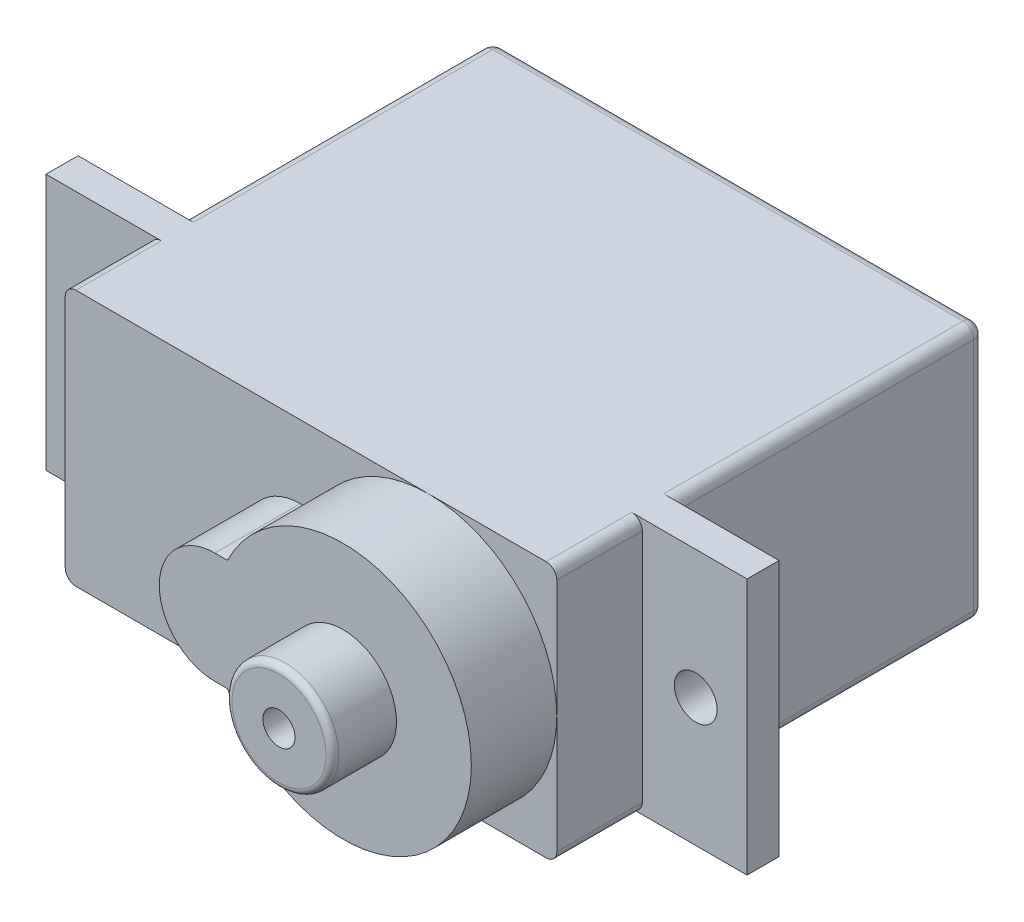
ISO-10303-21;
HEADER;
FILE_DESCRIPTION(('STEP AP214'),'2;1');
FILE_NAME('part.step','',(''),(''),'','','');
FILE_SCHEMA(('AUTOMOTIVE_DESIGN { 1 0 10303 214 1 1 1 1 }'));
ENDSEC;
DATA;
#1=APPLICATION_CONTEXT('core data for automotive mechanical design processes');
#2=APPLICATION_PROTOCOL_DEFINITION('international standard','automotive_design',2000,#1);
#3=PRODUCT_CONTEXT('',#1,'mechanical');
#4=PRODUCT('Part','Part','',(#3));
#5=PRODUCT_RELATED_PRODUCT_CATEGORY('part','',(#4));
#6=PRODUCT_DEFINITION_FORMATION('','',#4);
#7=PRODUCT_DEFINITION_CONTEXT('part definition',#1,'design');
#8=PRODUCT_DEFINITION('design','',#6,#7);
#9=PRODUCT_DEFINITION_SHAPE('','',#8);
#10=(LENGTH_UNIT() NAMED_UNIT(*) SI_UNIT(.MILLI.,.METRE.));
#11=(NAMED_UNIT(*) PLANE_ANGLE_UNIT() SI_UNIT($,.RADIAN.));
#12=(NAMED_UNIT(*) SI_UNIT($,.STERADIAN.) SOLID_ANGLE_UNIT());
#13=UNCERTAINTY_MEASURE_WITH_UNIT(LENGTH_MEASURE(1.E-05),#10,'distance_accuracy_value','');
#14=(GEOMETRIC_REPRESENTATION_CONTEXT(3) GLOBAL_UNCERTAINTY_ASSIGNED_CONTEXT((#13)) GLOBAL_UNIT_ASSIGNED_CONTEXT((#10,
#11,#12)) REPRESENTATION_CONTEXT('',''));
#15=CARTESIAN_POINT('',(0.,0.,0.));
#16=DIRECTION('',(0.,0.,1.));
#17=DIRECTION('',(1.,0.,0.));
#18=AXIS2_PLACEMENT_3D('',#15,#16,#17);
#19=CARTESIAN_POINT('',(0.,0.,5.5));
#20=DIRECTION('',(0.,0.,1.));
#21=DIRECTION('',(1.,0.,0.));
#22=AXIS2_PLACEMENT_3D('',#19,#20,#21);
#23=PLANE('',#22);
#24=DIRECTION('',(0.,-1.,0.));
#25=VECTOR('',#24,1.);
#26=CARTESIAN_POINT('',(-11.5,6.,5.5));
#27=LINE('',#26,#25);
#28=CARTESIAN_POINT('',(-11.5,5.5,5.5));
#29=VERTEX_POINT('',#28);
#30=CARTESIAN_POINT('',(-11.5,-5.5,5.5));
#31=VERTEX_POINT('',#30);
#32=EDGE_CURVE('E290',#29,#31,#27,.T.);
#33=ORIENTED_EDGE('',*,*,#32,.T.);
#34=CARTESIAN_POINT('',(-11.,-5.5,5.5));
#35=DIRECTION('',(0.,0.,1.));
#36=DIRECTION('',(1.,0.,0.));
#37=AXIS2_PLACEMENT_3D('',#34,#35,#36);
#38=CIRCLE('',#37,0.5);
#39=CARTESIAN_POINT('',(-11.,-6.,5.5));
#40=VERTEX_POINT('',#39);
#41=EDGE_CURVE('E546',#31,#40,#38,.T.);
#42=ORIENTED_EDGE('',*,*,#41,.T.);
#43=DIRECTION('',(1.,0.,0.));
#44=VECTOR('',#43,1.);
#45=CARTESIAN_POINT('',(-11.5,-6.,5.5));
#46=LINE('',#45,#44);
#47=CARTESIAN_POINT('',(5.5,-6.,5.5));
#48=VERTEX_POINT('',#47);
#49=EDGE_CURVE('E461',#40,#48,#46,.T.);
#50=ORIENTED_EDGE('',*,*,#49,.T.);
#51=CARTESIAN_POINT('',(5.5,0.,5.5));
#52=DIRECTION('',(0.,0.,1.));
#53=DIRECTION('',(1.,0.,0.));
#54=AXIS2_PLACEMENT_3D('',#51,#52,#53);
#55=CIRCLE('',#54,6.);
#56=CARTESIAN_POINT('',(0.0925976661616881,-2.6,5.5));
#57=VERTEX_POINT('',#56);
#58=EDGE_CURVE('E440',#57,#48,#55,.T.);
#59=ORIENTED_EDGE('',*,*,#58,.F.);
#60=DIRECTION('',(1.,0.,0.));
#61=VECTOR('',#60,1.);
#62=CARTESIAN_POINT('',(-0.5,-2.6,5.5));
#63=LINE('',#62,#61);
#64=CARTESIAN_POINT('',(-0.5,-2.6,5.5));
#65=VERTEX_POINT('',#64);
#66=EDGE_CURVE('E242',#65,#57,#63,.T.);
#67=ORIENTED_EDGE('',*,*,#66,.F.);
#68=CARTESIAN_POINT('',(-0.5,0.,5.5));
#69=DIRECTION('',(0.,0.,1.));
#70=DIRECTION('',(1.,0.,0.));
#71=AXIS2_PLACEMENT_3D('',#68,#69,#70);
#72=CIRCLE('',#71,2.6);
#73=CARTESIAN_POINT('',(-0.5,2.6,5.5));
#74=VERTEX_POINT('',#73);
#75=EDGE_CURVE('E449',#74,#65,#72,.T.);
#76=ORIENTED_EDGE('',*,*,#75,.F.);
#77=DIRECTION('',(-1.,0.,0.));
#78=VECTOR('',#77,1.);
#79=CARTESIAN_POINT('',(-0.5,2.6,5.5));
#80=LINE('',#79,#78);
#81=CARTESIAN_POINT('',(0.0925976661616881,2.6,5.5));
#82=VERTEX_POINT('',#81);
#83=EDGE_CURVE('E446',#82,#74,#80,.T.);
#84=ORIENTED_EDGE('',*,*,#83,.F.);
#85=CARTESIAN_POINT('',(5.5,6.,5.5));
#86=VERTEX_POINT('',#85);
#87=EDGE_CURVE('E249',#86,#82,#55,.T.);
#88=ORIENTED_EDGE('',*,*,#87,.F.);
#89=DIRECTION('',(-1.,0.,0.));
#90=VECTOR('',#89,1.);
#91=CARTESIAN_POINT('',(-11.5,6.,5.5));
#92=LINE('',#91,#90);
#93=CARTESIAN_POINT('',(-11.,6.,5.5));
#94=VERTEX_POINT('',#93);
#95=EDGE_CURVE('E570',#86,#94,#92,.T.);
#96=ORIENTED_EDGE('',*,*,#95,.T.);
#97=CARTESIAN_POINT('',(-11.,5.5,5.5));
#98=DIRECTION('',(0.,0.,1.));
#99=DIRECTION('',(1.,0.,0.));
#100=AXIS2_PLACEMENT_3D('',#97,#98,#99);
#101=CIRCLE('',#100,0.5);
#102=EDGE_CURVE('E60',#94,#29,#101,.T.);
#103=ORIENTED_EDGE('',*,*,#102,.T.);
#104=EDGE_LOOP('',(#33,#42,#50,#59,#67,#76,#84,#88,#96,#103));
#105=FACE_BOUND('',#104,.T.);
#106=ADVANCED_FACE('F36',(#105),#23,.T.);
#107=CARTESIAN_POINT('',(11.,-6.,5.5));
#108=VERTEX_POINT('',#107);
#109=EDGE_CURVE('E571',#48,#108,#46,.T.);
#110=ORIENTED_EDGE('',*,*,#109,.T.);
#111=CARTESIAN_POINT('',(11.,-5.5,5.5));
#112=DIRECTION('',(0.,0.,1.));
#113=DIRECTION('',(1.,0.,0.));
#114=AXIS2_PLACEMENT_3D('',#111,#112,#113);
#115=CIRCLE('',#114,0.5);
#116=CARTESIAN_POINT('',(11.5,-5.5,5.5));
#117=VERTEX_POINT('',#116);
#118=EDGE_CURVE('E556',#108,#117,#115,.T.);
#119=ORIENTED_EDGE('',*,*,#118,.T.);
#120=DIRECTION('',(0.,1.,0.));
#121=VECTOR('',#120,1.);
#122=CARTESIAN_POINT('',(11.5,6.,5.5));
#123=LINE('',#122,#121);
#124=CARTESIAN_POINT('',(11.5,0.,5.5));
#125=VERTEX_POINT('',#124);
#126=EDGE_CURVE('E568',#117,#125,#123,.T.);
#127=ORIENTED_EDGE('',*,*,#126,.T.);
#128=EDGE_CURVE('E447',#48,#125,#55,.T.);
#129=ORIENTED_EDGE('',*,*,#128,.F.);
#130=EDGE_LOOP('',(#110,#119,#127,#129));
#131=FACE_BOUND('',#130,.T.);
#132=ADVANCED_FACE('F588',(#131),#23,.T.);
#133=CARTESIAN_POINT('',(0.,0.,0.));
#134=DIRECTION('',(0.,0.,1.));
#135=DIRECTION('',(1.,0.,0.));
#136=AXIS2_PLACEMENT_3D('',#133,#134,#135);
#137=PLANE('',#136);
#138=CARTESIAN_POINT('',(14.,0.,0.));
#139=DIRECTION('',(0.,0.,1.));
#140=DIRECTION('',(1.,0.,0.));
#141=AXIS2_PLACEMENT_3D('',#138,#139,#140);
#142=CIRCLE('',#141,1.);
#143=CARTESIAN_POINT('',(15.,0.,0.));
#144=VERTEX_POINT('',#143);
#145=EDGE_CURVE('E253',#144,#144,#142,.T.);
#146=ORIENTED_EDGE('',*,*,#145,.T.);
#147=EDGE_LOOP('',(#146));
#148=FACE_BOUND('',#147,.T.);
#149=DIRECTION('',(0.,-1.,0.));
#150=VECTOR('',#149,1.);
#151=CARTESIAN_POINT('',(11.5,6.,0.));
#152=LINE('',#151,#150);
#153=CARTESIAN_POINT('',(11.5,5.5,0.));
#154=VERTEX_POINT('',#153);
#155=CARTESIAN_POINT('',(11.5,-5.5,0.));
#156=VERTEX_POINT('',#155);
#157=EDGE_CURVE('E267',#154,#156,#152,.T.);
#158=ORIENTED_EDGE('',*,*,#157,.F.);
#159=CARTESIAN_POINT('',(11.,5.5,0.));
#160=DIRECTION('',(0.,0.,1.));
#161=DIRECTION('',(1.,0.,0.));
#162=AXIS2_PLACEMENT_3D('',#159,#160,#161);
#163=CIRCLE('',#162,0.5);
#164=CARTESIAN_POINT('',(11.,6.,0.));
#165=VERTEX_POINT('',#164);
#166=EDGE_CURVE('E369',#154,#165,#163,.T.);
#167=ORIENTED_EDGE('',*,*,#166,.T.);
#168=DIRECTION('',(-1.,0.,0.));
#169=VECTOR('',#168,1.);
#170=CARTESIAN_POINT('',(-16.4,6.,0.));
#171=LINE('',#170,#169);
#172=CARTESIAN_POINT('',(16.4,6.,0.));
#173=VERTEX_POINT('',#172);
#174=EDGE_CURVE('E302',#173,#165,#171,.T.);
#175=ORIENTED_EDGE('',*,*,#174,.F.);
#176=DIRECTION('',(0.,1.,0.));
#177=VECTOR('',#176,1.);
#178=CARTESIAN_POINT('',(16.4,6.,0.));
#179=LINE('',#178,#177);
#180=CARTESIAN_POINT('',(16.4,-6.,0.));
#181=VERTEX_POINT('',#180);
#182=EDGE_CURVE('E328',#181,#173,#179,.T.);
#183=ORIENTED_EDGE('',*,*,#182,.F.);
#184=DIRECTION('',(1.,0.,0.));
#185=VECTOR('',#184,1.);
#186=CARTESIAN_POINT('',(-16.4,-6.,0.));
#187=LINE('',#186,#185);
#188=CARTESIAN_POINT('',(11.,-6.,0.));
#189=VERTEX_POINT('',#188);
#190=EDGE_CURVE('E342',#189,#181,#187,.T.);
#191=ORIENTED_EDGE('',*,*,#190,.F.);
#192=CARTESIAN_POINT('',(11.,-5.5,0.));
#193=DIRECTION('',(0.,0.,1.));
#194=DIRECTION('',(1.,0.,0.));
#195=AXIS2_PLACEMENT_3D('',#192,#193,#194);
#196=CIRCLE('',#195,0.5);
#197=EDGE_CURVE('E539',#189,#156,#196,.T.);
#198=ORIENTED_EDGE('',*,*,#197,.T.);
#199=EDGE_LOOP('',(#158,#167,#175,#183,#191,#198));
#200=FACE_BOUND('',#199,.T.);
#201=ADVANCED_FACE('F366',(#148,#200),#137,.F.);
#202=CARTESIAN_POINT('',(-14.,0.,0.));
#203=DIRECTION('',(0.,0.,1.));
#204=DIRECTION('',(1.,0.,0.));
#205=AXIS2_PLACEMENT_3D('',#202,#203,#204);
#206=CIRCLE('',#205,1.);
#207=CARTESIAN_POINT('',(-13.,0.,0.));
#208=VERTEX_POINT('',#207);
#209=EDGE_CURVE('E264',#208,#208,#206,.T.);
#210=ORIENTED_EDGE('',*,*,#209,.T.);
#211=EDGE_LOOP('',(#210));
#212=FACE_BOUND('',#211,.T.);
#213=DIRECTION('',(0.,1.,0.));
#214=VECTOR('',#213,1.);
#215=CARTESIAN_POINT('',(-11.5,6.,0.));
#216=LINE('',#215,#214);
#217=CARTESIAN_POINT('',(-11.5,-5.5,0.));
#218=VERTEX_POINT('',#217);
#219=CARTESIAN_POINT('',(-11.5,5.5,0.));
#220=VERTEX_POINT('',#219);
#221=EDGE_CURVE('E276',#218,#220,#216,.T.);
#222=ORIENTED_EDGE('',*,*,#221,.F.);
#223=CARTESIAN_POINT('',(-11.,-5.5,0.));
#224=DIRECTION('',(0.,0.,1.));
#225=DIRECTION('',(1.,0.,0.));
#226=AXIS2_PLACEMENT_3D('',#223,#224,#225);
#227=CIRCLE('',#226,0.5);
#228=CARTESIAN_POINT('',(-11.,-6.,0.));
#229=VERTEX_POINT('',#228);
#230=EDGE_CURVE('E391',#218,#229,#227,.T.);
#231=ORIENTED_EDGE('',*,*,#230,.T.);
#232=CARTESIAN_POINT('',(-16.4,-6.,0.));
#233=VERTEX_POINT('',#232);
#234=EDGE_CURVE('E348',#233,#229,#187,.T.);
#235=ORIENTED_EDGE('',*,*,#234,.F.);
#236=DIRECTION('',(0.,-1.,0.));
#237=VECTOR('',#236,1.);
#238=CARTESIAN_POINT('',(-16.4,6.,0.));
#239=LINE('',#238,#237);
#240=CARTESIAN_POINT('',(-16.4,6.,0.));
#241=VERTEX_POINT('',#240);
#242=EDGE_CURVE('E339',#241,#233,#239,.T.);
#243=ORIENTED_EDGE('',*,*,#242,.F.);
#244=CARTESIAN_POINT('',(-11.,6.,0.));
#245=VERTEX_POINT('',#244);
#246=EDGE_CURVE('E332',#245,#241,#171,.T.);
#247=ORIENTED_EDGE('',*,*,#246,.F.);
#248=CARTESIAN_POINT('',(-11.,5.5,0.));
#249=DIRECTION('',(0.,0.,1.));
#250=DIRECTION('',(1.,0.,0.));
#251=AXIS2_PLACEMENT_3D('',#248,#249,#250);
#252=CIRCLE('',#251,0.5);
#253=EDGE_CURVE('E388',#245,#220,#252,.T.);
#254=ORIENTED_EDGE('',*,*,#253,.T.);
#255=EDGE_LOOP('',(#222,#231,#235,#243,#247,#254));
#256=FACE_BOUND('',#255,.T.);
#257=ADVANCED_FACE('F627',(#212,#256),#137,.F.);
#258=CARTESIAN_POINT('',(0.,0.,1.5));
#259=DIRECTION('',(0.,0.,1.));
#260=DIRECTION('',(1.,0.,0.));
#261=AXIS2_PLACEMENT_3D('',#258,#259,#260);
#262=PLANE('',#261);
#263=CARTESIAN_POINT('',(-14.,0.,1.5));
#264=DIRECTION('',(0.,0.,1.));
#265=DIRECTION('',(1.,0.,0.));
#266=AXIS2_PLACEMENT_3D('',#263,#264,#265);
#267=CIRCLE('',#266,1.);
#268=CARTESIAN_POINT('',(-13.,0.,1.5));
#269=VERTEX_POINT('',#268);
#270=EDGE_CURVE('E261',#269,#269,#267,.T.);
#271=ORIENTED_EDGE('',*,*,#270,.F.);
#272=EDGE_LOOP('',(#271));
#273=FACE_BOUND('',#272,.T.);
#274=DIRECTION('',(0.,-1.,0.));
#275=VECTOR('',#274,1.);
#276=CARTESIAN_POINT('',(-11.5,6.,1.5));
#277=LINE('',#276,#275);
#278=CARTESIAN_POINT('',(-11.5,5.5,1.5));
#279=VERTEX_POINT('',#278);
#280=CARTESIAN_POINT('',(-11.5,-5.5,1.5));
#281=VERTEX_POINT('',#280);
#282=EDGE_CURVE('E291',#279,#281,#277,.T.);
#283=ORIENTED_EDGE('',*,*,#282,.F.);
#284=CARTESIAN_POINT('',(-11.,5.5,1.5));
#285=DIRECTION('',(0.,0.,1.));
#286=DIRECTION('',(1.,0.,0.));
#287=AXIS2_PLACEMENT_3D('',#284,#285,#286);
#288=CIRCLE('',#287,0.5);
#289=CARTESIAN_POINT('',(-11.,6.,1.5));
#290=VERTEX_POINT('',#289);
#291=EDGE_CURVE('E11',#279,#290,#288,.F.);
#292=ORIENTED_EDGE('',*,*,#291,.T.);
#293=DIRECTION('',(-1.,0.,0.));
#294=VECTOR('',#293,1.);
#295=CARTESIAN_POINT('',(-16.4,6.,1.5));
#296=LINE('',#295,#294);
#297=CARTESIAN_POINT('',(-16.4,6.,1.5));
#298=VERTEX_POINT('',#297);
#299=EDGE_CURVE('E336',#290,#298,#296,.T.);
#300=ORIENTED_EDGE('',*,*,#299,.T.);
#301=DIRECTION('',(0.,-1.,0.));
#302=VECTOR('',#301,1.);
#303=CARTESIAN_POINT('',(-16.4,6.,1.5));
#304=LINE('',#303,#302);
#305=CARTESIAN_POINT('',(-16.4,-6.,1.5));
#306=VERTEX_POINT('',#305);
#307=EDGE_CURVE('E298',#298,#306,#304,.T.);
#308=ORIENTED_EDGE('',*,*,#307,.T.);
#309=DIRECTION('',(1.,0.,0.));
#310=VECTOR('',#309,1.);
#311=CARTESIAN_POINT('',(-16.4,-6.,1.5));
#312=LINE('',#311,#310);
#313=CARTESIAN_POINT('',(-11.,-6.,1.5));
#314=VERTEX_POINT('',#313);
#315=EDGE_CURVE('E311',#306,#314,#312,.T.);
#316=ORIENTED_EDGE('',*,*,#315,.T.);
#317=CARTESIAN_POINT('',(-11.,-5.5,1.5));
#318=DIRECTION('',(0.,0.,1.));
#319=DIRECTION('',(1.,0.,0.));
#320=AXIS2_PLACEMENT_3D('',#317,#318,#319);
#321=CIRCLE('',#320,0.5);
#322=EDGE_CURVE('E45',#314,#281,#321,.F.);
#323=ORIENTED_EDGE('',*,*,#322,.T.);
#324=EDGE_LOOP('',(#283,#292,#300,#308,#316,#323));
#325=FACE_BOUND('',#324,.T.);
#326=ADVANCED_FACE('F580',(#273,#325),#262,.T.);
#327=CARTESIAN_POINT('',(-16.4,6.,1.5));
#328=DIRECTION('',(1.,0.,0.));
#329=DIRECTION('',(0.,0.,-1.));
#330=AXIS2_PLACEMENT_3D('',#327,#328,#329);
#331=PLANE('',#330);
#332=ORIENTED_EDGE('',*,*,#242,.T.);
#333=DIRECTION('',(0.,0.,-1.));
#334=VECTOR('',#333,1.);
#335=CARTESIAN_POINT('',(-16.4,-6.,1.5));
#336=LINE('',#335,#334);
#337=EDGE_CURVE('E313',#306,#233,#336,.T.);
#338=ORIENTED_EDGE('',*,*,#337,.F.);
#339=ORIENTED_EDGE('',*,*,#307,.F.);
#340=DIRECTION('',(0.,0.,-1.));
#341=VECTOR('',#340,1.);
#342=CARTESIAN_POINT('',(-16.4,6.,1.5));
#343=LINE('',#342,#341);
#344=EDGE_CURVE('E322',#298,#241,#343,.T.);
#345=ORIENTED_EDGE('',*,*,#344,.T.);
#346=EDGE_LOOP('',(#332,#338,#339,#345));
#347=FACE_BOUND('',#346,.T.);
#348=ADVANCED_FACE('F635',(#347),#331,.F.);
#349=CARTESIAN_POINT('',(-16.4,-6.,1.5));
#350=DIRECTION('',(0.,1.,0.));
#351=DIRECTION('',(-1.,0.,0.));
#352=AXIS2_PLACEMENT_3D('',#349,#350,#351);
#353=PLANE('',#352);
#354=CARTESIAN_POINT('',(11.,-6.,1.5));
#355=VERTEX_POINT('',#354);
#356=CARTESIAN_POINT('',(16.4,-6.,1.5));
#357=VERTEX_POINT('',#356);
#358=EDGE_CURVE('E301',#355,#357,#312,.T.);
#359=ORIENTED_EDGE('',*,*,#358,.F.);
#360=DIRECTION('',(0.,0.,-1.));
#361=VECTOR('',#360,1.);
#362=CARTESIAN_POINT('',(11.,-6.,1.5));
#363=LINE('',#362,#361);
#364=EDGE_CURVE('E494',#355,#108,#363,.F.);
#365=ORIENTED_EDGE('',*,*,#364,.T.);
#366=ORIENTED_EDGE('',*,*,#109,.F.);
#367=ORIENTED_EDGE('',*,*,#49,.F.);
#368=DIRECTION('',(0.,0.,-1.));
#369=VECTOR('',#368,1.);
#370=CARTESIAN_POINT('',(-11.,-6.,1.5));
#371=LINE('',#370,#369);
#372=EDGE_CURVE('E486',#40,#314,#371,.T.);
#373=ORIENTED_EDGE('',*,*,#372,.T.);
#374=ORIENTED_EDGE('',*,*,#315,.F.);
#375=ORIENTED_EDGE('',*,*,#337,.T.);
#376=ORIENTED_EDGE('',*,*,#234,.T.);
#377=DIRECTION('',(0.,0.,1.));
#378=VECTOR('',#377,1.);
#379=CARTESIAN_POINT('',(-11.,-6.,1.5));
#380=LINE('',#379,#378);
#381=CARTESIAN_POINT('',(-11.,-6.,-14.));
#382=VERTEX_POINT('',#381);
#383=EDGE_CURVE('E489',#229,#382,#380,.F.);
#384=ORIENTED_EDGE('',*,*,#383,.T.);
#385=DIRECTION('',(-1.,0.,0.));
#386=VECTOR('',#385,1.);
#387=CARTESIAN_POINT('',(11.5,-6.,-14.));
#388=LINE('',#387,#386);
#389=CARTESIAN_POINT('',(11.,-6.,-14.));
#390=VERTEX_POINT('',#389);
#391=EDGE_CURVE('E491',#382,#390,#388,.F.);
#392=ORIENTED_EDGE('',*,*,#391,.T.);
#393=DIRECTION('',(0.,0.,1.));
#394=VECTOR('',#393,1.);
#395=CARTESIAN_POINT('',(11.,-6.,1.5));
#396=LINE('',#395,#394);
#397=EDGE_CURVE('E357',#390,#189,#396,.T.);
#398=ORIENTED_EDGE('',*,*,#397,.T.);
#399=ORIENTED_EDGE('',*,*,#190,.T.);
#400=DIRECTION('',(0.,0.,-1.));
#401=VECTOR('',#400,1.);
#402=CARTESIAN_POINT('',(16.4,-6.,1.5));
#403=LINE('',#402,#401);
#404=EDGE_CURVE('E316',#357,#181,#403,.T.);
#405=ORIENTED_EDGE('',*,*,#404,.F.);
#406=EDGE_LOOP('',(#359,#365,#366,#367,#373,#374,#375,#376,#384,#392,#398,#399,#405));
#407=FACE_BOUND('',#406,.T.);
#408=ADVANCED_FACE('F353',(#407),#353,.F.);
#409=CARTESIAN_POINT('',(16.4,6.,1.5));
#410=DIRECTION('',(-1.,0.,0.));
#411=DIRECTION('',(0.,0.,1.));
#412=AXIS2_PLACEMENT_3D('',#409,#410,#411);
#413=PLANE('',#412);
#414=ORIENTED_EDGE('',*,*,#182,.T.);
#415=DIRECTION('',(0.,0.,-1.));
#416=VECTOR('',#415,1.);
#417=CARTESIAN_POINT('',(16.4,6.,1.5));
#418=LINE('',#417,#416);
#419=CARTESIAN_POINT('',(16.4,6.,1.5));
#420=VERTEX_POINT('',#419);
#421=EDGE_CURVE('E319',#420,#173,#418,.T.);
#422=ORIENTED_EDGE('',*,*,#421,.F.);
#423=DIRECTION('',(0.,1.,0.));
#424=VECTOR('',#423,1.);
#425=CARTESIAN_POINT('',(16.4,6.,1.5));
#426=LINE('',#425,#424);
#427=EDGE_CURVE('E305',#357,#420,#426,.T.);
#428=ORIENTED_EDGE('',*,*,#427,.F.);
#429=ORIENTED_EDGE('',*,*,#404,.T.);
#430=EDGE_LOOP('',(#414,#422,#428,#429));
#431=FACE_BOUND('',#430,.T.);
#432=ADVANCED_FACE('F362',(#431),#413,.F.);
#433=CARTESIAN_POINT('',(-16.4,6.,1.5));
#434=DIRECTION('',(0.,-1.,0.));
#435=DIRECTION('',(1.,0.,0.));
#436=AXIS2_PLACEMENT_3D('',#433,#434,#435);
#437=PLANE('',#436);
#438=ORIENTED_EDGE('',*,*,#174,.T.);
#439=DIRECTION('',(0.,0.,1.));
#440=VECTOR('',#439,1.);
#441=CARTESIAN_POINT('',(11.,6.,1.5));
#442=LINE('',#441,#440);
#443=CARTESIAN_POINT('',(11.,6.,-14.));
#444=VERTEX_POINT('',#443);
#445=EDGE_CURVE('E277',#165,#444,#442,.F.);
#446=ORIENTED_EDGE('',*,*,#445,.T.);
#447=DIRECTION('',(1.,0.,0.));
#448=VECTOR('',#447,1.);
#449=CARTESIAN_POINT('',(-11.5,6.,-14.));
#450=LINE('',#449,#448);
#451=CARTESIAN_POINT('',(-11.,6.,-14.));
#452=VERTEX_POINT('',#451);
#453=EDGE_CURVE('E509',#444,#452,#450,.F.);
#454=ORIENTED_EDGE('',*,*,#453,.T.);
#455=DIRECTION('',(0.,0.,1.));
#456=VECTOR('',#455,1.);
#457=CARTESIAN_POINT('',(-11.,6.,1.5));
#458=LINE('',#457,#456);
#459=EDGE_CURVE('E507',#452,#245,#458,.T.);
#460=ORIENTED_EDGE('',*,*,#459,.T.);
#461=ORIENTED_EDGE('',*,*,#246,.T.);
#462=ORIENTED_EDGE('',*,*,#344,.F.);
#463=ORIENTED_EDGE('',*,*,#299,.F.);
#464=DIRECTION('',(0.,0.,-1.));
#465=VECTOR('',#464,1.);
#466=CARTESIAN_POINT('',(-11.,6.,1.5));
#467=LINE('',#466,#465);
#468=EDGE_CURVE('E504',#290,#94,#467,.F.);
#469=ORIENTED_EDGE('',*,*,#468,.T.);
#470=ORIENTED_EDGE('',*,*,#95,.F.);
#471=CARTESIAN_POINT('',(11.,6.,5.5));
#472=VERTEX_POINT('',#471);
#473=EDGE_CURVE('E343',#472,#86,#92,.T.);
#474=ORIENTED_EDGE('',*,*,#473,.F.);
#475=DIRECTION('',(0.,0.,-1.));
#476=VECTOR('',#475,1.);
#477=CARTESIAN_POINT('',(11.,6.,1.5));
#478=LINE('',#477,#476);
#479=CARTESIAN_POINT('',(11.,6.,1.5));
#480=VERTEX_POINT('',#479);
#481=EDGE_CURVE('E378',#472,#480,#478,.T.);
#482=ORIENTED_EDGE('',*,*,#481,.T.);
#483=EDGE_CURVE('E325',#420,#480,#296,.T.);
#484=ORIENTED_EDGE('',*,*,#483,.F.);
#485=ORIENTED_EDGE('',*,*,#421,.T.);
#486=EDGE_LOOP('',(#438,#446,#454,#460,#461,#462,#463,#469,#470,#474,#482,#484,#485));
#487=FACE_BOUND('',#486,.T.);
#488=ADVANCED_FACE('F372',(#487),#437,.F.);
#489=CARTESIAN_POINT('',(14.,0.,1.5));
#490=DIRECTION('',(0.,0.,1.));
#491=DIRECTION('',(1.,0.,0.));
#492=AXIS2_PLACEMENT_3D('',#489,#490,#491);
#493=CIRCLE('',#492,1.);
#494=CARTESIAN_POINT('',(15.,0.,1.5));
#495=VERTEX_POINT('',#494);
#496=EDGE_CURVE('E250',#495,#495,#493,.T.);
#497=ORIENTED_EDGE('',*,*,#496,.F.);
#498=EDGE_LOOP('',(#497));
#499=FACE_BOUND('',#498,.T.);
#500=DIRECTION('',(0.,1.,0.));
#501=VECTOR('',#500,1.);
#502=CARTESIAN_POINT('',(11.5,6.,1.5));
#503=LINE('',#502,#501);
#504=CARTESIAN_POINT('',(11.5,-5.5,1.5));
#505=VERTEX_POINT('',#504);
#506=CARTESIAN_POINT('',(11.5,5.5,1.5));
#507=VERTEX_POINT('',#506);
#508=EDGE_CURVE('E286',#505,#507,#503,.T.);
#509=ORIENTED_EDGE('',*,*,#508,.F.);
#510=CARTESIAN_POINT('',(11.,-5.5,1.5));
#511=DIRECTION('',(0.,0.,1.));
#512=DIRECTION('',(1.,0.,0.));
#513=AXIS2_PLACEMENT_3D('',#510,#511,#512);
#514=CIRCLE('',#513,0.5);
#515=EDGE_CURVE('E543',#505,#355,#514,.F.);
#516=ORIENTED_EDGE('',*,*,#515,.T.);
#517=ORIENTED_EDGE('',*,*,#358,.T.);
#518=ORIENTED_EDGE('',*,*,#427,.T.);
#519=ORIENTED_EDGE('',*,*,#483,.T.);
#520=CARTESIAN_POINT('',(11.,5.5,1.5));
#521=DIRECTION('',(0.,0.,1.));
#522=DIRECTION('',(1.,0.,0.));
#523=AXIS2_PLACEMENT_3D('',#520,#521,#522);
#524=CIRCLE('',#523,0.5);
#525=EDGE_CURVE('E383',#480,#507,#524,.F.);
#526=ORIENTED_EDGE('',*,*,#525,.T.);
#527=EDGE_LOOP('',(#509,#516,#517,#518,#519,#526));
#528=FACE_BOUND('',#527,.T.);
#529=ADVANCED_FACE('F382',(#499,#528),#262,.T.);
#530=CARTESIAN_POINT('',(-11.5,6.,5.5));
#531=DIRECTION('',(1.,0.,0.));
#532=DIRECTION('',(0.,1.,0.));
#533=AXIS2_PLACEMENT_3D('',#530,#531,#532);
#534=PLANE('',#533);
#535=ORIENTED_EDGE('',*,*,#282,.T.);
#536=DIRECTION('',(0.,0.,-1.));
#537=VECTOR('',#536,1.);
#538=CARTESIAN_POINT('',(-11.5,-5.5,5.5));
#539=LINE('',#538,#537);
#540=EDGE_CURVE('E53',#281,#31,#539,.F.);
#541=ORIENTED_EDGE('',*,*,#540,.T.);
#542=ORIENTED_EDGE('',*,*,#32,.F.);
#543=DIRECTION('',(0.,0.,-1.));
#544=VECTOR('',#543,1.);
#545=CARTESIAN_POINT('',(-11.5,5.5,5.5));
#546=LINE('',#545,#544);
#547=EDGE_CURVE('E550',#29,#279,#546,.T.);
#548=ORIENTED_EDGE('',*,*,#547,.T.);
#549=EDGE_LOOP('',(#535,#541,#542,#548));
#550=FACE_BOUND('',#549,.T.);
#551=ADVANCED_FACE('F578',(#550),#534,.F.);
#552=CARTESIAN_POINT('',(11.5,6.,5.5));
#553=DIRECTION('',(-1.,0.,0.));
#554=DIRECTION('',(0.,0.,1.));
#555=AXIS2_PLACEMENT_3D('',#552,#553,#554);
#556=PLANE('',#555);
#557=ORIENTED_EDGE('',*,*,#126,.F.);
#558=DIRECTION('',(0.,0.,-1.));
#559=VECTOR('',#558,1.);
#560=CARTESIAN_POINT('',(11.5,-5.5,5.5));
#561=LINE('',#560,#559);
#562=EDGE_CURVE('E557',#117,#505,#561,.T.);
#563=ORIENTED_EDGE('',*,*,#562,.T.);
#564=ORIENTED_EDGE('',*,*,#508,.T.);
#565=DIRECTION('',(0.,0.,-1.));
#566=VECTOR('',#565,1.);
#567=CARTESIAN_POINT('',(11.5,5.5,5.5));
#568=LINE('',#567,#566);
#569=CARTESIAN_POINT('',(11.5,5.5,5.5));
#570=VERTEX_POINT('',#569);
#571=EDGE_CURVE('E285',#507,#570,#568,.F.);
#572=ORIENTED_EDGE('',*,*,#571,.T.);
#573=EDGE_CURVE('E565',#125,#570,#123,.T.);
#574=ORIENTED_EDGE('',*,*,#573,.F.);
#575=EDGE_LOOP('',(#557,#563,#564,#572,#574));
#576=FACE_BOUND('',#575,.T.);
#577=ADVANCED_FACE('F564',(#576),#556,.F.);
#578=ORIENTED_EDGE('',*,*,#573,.T.);
#579=CARTESIAN_POINT('',(11.,5.5,5.5));
#580=DIRECTION('',(0.,0.,1.));
#581=DIRECTION('',(1.,0.,0.));
#582=AXIS2_PLACEMENT_3D('',#579,#580,#581);
#583=CIRCLE('',#582,0.5);
#584=EDGE_CURVE('E553',#570,#472,#583,.T.);
#585=ORIENTED_EDGE('',*,*,#584,.T.);
#586=ORIENTED_EDGE('',*,*,#473,.T.);
#587=EDGE_CURVE('E465',#125,#86,#55,.T.);
#588=ORIENTED_EDGE('',*,*,#587,.F.);
#589=EDGE_LOOP('',(#578,#585,#586,#588));
#590=FACE_BOUND('',#589,.T.);
#591=ADVANCED_FACE('F567',(#590),#23,.T.);
#592=CARTESIAN_POINT('',(11.5,6.,-14.5));
#593=DIRECTION('',(-1.,0.,0.));
#594=DIRECTION('',(0.,-1.,0.));
#595=AXIS2_PLACEMENT_3D('',#592,#593,#594);
#596=PLANE('',#595);
#597=ORIENTED_EDGE('',*,*,#157,.T.);
#598=DIRECTION('',(0.,0.,1.));
#599=VECTOR('',#598,1.);
#600=CARTESIAN_POINT('',(11.5,-5.5,-14.5));
#601=LINE('',#600,#599);
#602=CARTESIAN_POINT('',(11.5,-5.5,-14.));
#603=VERTEX_POINT('',#602);
#604=EDGE_CURVE('E283',#156,#603,#601,.F.);
#605=ORIENTED_EDGE('',*,*,#604,.T.);
#606=DIRECTION('',(0.,-1.,0.));
#607=VECTOR('',#606,1.);
#608=CARTESIAN_POINT('',(11.5,6.,-14.));
#609=LINE('',#608,#607);
#610=CARTESIAN_POINT('',(11.5,5.5,-14.));
#611=VERTEX_POINT('',#610);
#612=EDGE_CURVE('E281',#603,#611,#609,.F.);
#613=ORIENTED_EDGE('',*,*,#612,.T.);
#614=DIRECTION('',(0.,0.,1.));
#615=VECTOR('',#614,1.);
#616=CARTESIAN_POINT('',(11.5,5.5,-14.5));
#617=LINE('',#616,#615);
#618=EDGE_CURVE('E279',#611,#154,#617,.T.);
#619=ORIENTED_EDGE('',*,*,#618,.T.);
#620=EDGE_LOOP('',(#597,#605,#613,#619));
#621=FACE_BOUND('',#620,.T.);
#622=ADVANCED_FACE('F611',(#621),#596,.F.);
#623=CARTESIAN_POINT('',(-11.5,6.,-14.5));
#624=DIRECTION('',(1.,0.,0.));
#625=DIRECTION('',(0.,1.,0.));
#626=AXIS2_PLACEMENT_3D('',#623,#624,#625);
#627=PLANE('',#626);
#628=DIRECTION('',(0.,1.,0.));
#629=VECTOR('',#628,1.);
#630=CARTESIAN_POINT('',(-11.5,-6.,-14.));
#631=LINE('',#630,#629);
#632=CARTESIAN_POINT('',(-11.5,5.5,-14.));
#633=VERTEX_POINT('',#632);
#634=CARTESIAN_POINT('',(-11.5,-5.5,-14.));
#635=VERTEX_POINT('',#634);
#636=EDGE_CURVE('E500',#633,#635,#631,.F.);
#637=ORIENTED_EDGE('',*,*,#636,.T.);
#638=DIRECTION('',(0.,0.,1.));
#639=VECTOR('',#638,1.);
#640=CARTESIAN_POINT('',(-11.5,-5.5,-14.5));
#641=LINE('',#640,#639);
#642=EDGE_CURVE('E502',#635,#218,#641,.T.);
#643=ORIENTED_EDGE('',*,*,#642,.T.);
#644=ORIENTED_EDGE('',*,*,#221,.T.);
#645=DIRECTION('',(0.,0.,1.));
#646=VECTOR('',#645,1.);
#647=CARTESIAN_POINT('',(-11.5,5.5,-14.5));
#648=LINE('',#647,#646);
#649=EDGE_CURVE('E496',#220,#633,#648,.F.);
#650=ORIENTED_EDGE('',*,*,#649,.T.);
#651=EDGE_LOOP('',(#637,#643,#644,#650));
#652=FACE_BOUND('',#651,.T.);
#653=ADVANCED_FACE('F530',(#652),#627,.F.);
#654=CARTESIAN_POINT('',(0.,0.,-14.5));
#655=DIRECTION('',(0.,0.,-1.));
#656=DIRECTION('',(-1.,0.,0.));
#657=AXIS2_PLACEMENT_3D('',#654,#655,#656);
#658=PLANE('',#657);
#659=DIRECTION('',(0.,-1.,0.));
#660=VECTOR('',#659,1.);
#661=CARTESIAN_POINT('',(11.,-6.,-14.5));
#662=LINE('',#661,#660);
#663=CARTESIAN_POINT('',(11.,5.5,-14.5));
#664=VERTEX_POINT('',#663);
#665=CARTESIAN_POINT('',(11.,-5.5,-14.5));
#666=VERTEX_POINT('',#665);
#667=EDGE_CURVE('E475',#664,#666,#662,.T.);
#668=ORIENTED_EDGE('',*,*,#667,.T.);
#669=DIRECTION('',(-1.,0.,0.));
#670=VECTOR('',#669,1.);
#671=CARTESIAN_POINT('',(-11.5,-5.5,-14.5));
#672=LINE('',#671,#670);
#673=CARTESIAN_POINT('',(-11.,-5.5,-14.5));
#674=VERTEX_POINT('',#673);
#675=EDGE_CURVE('E483',#666,#674,#672,.T.);
#676=ORIENTED_EDGE('',*,*,#675,.T.);
#677=DIRECTION('',(0.,1.,0.));
#678=VECTOR('',#677,1.);
#679=CARTESIAN_POINT('',(-11.,6.,-14.5));
#680=LINE('',#679,#678);
#681=CARTESIAN_POINT('',(-11.,5.5,-14.5));
#682=VERTEX_POINT('',#681);
#683=EDGE_CURVE('E481',#674,#682,#680,.T.);
#684=ORIENTED_EDGE('',*,*,#683,.T.);
#685=DIRECTION('',(1.,0.,0.));
#686=VECTOR('',#685,1.);
#687=CARTESIAN_POINT('',(11.5,5.5,-14.5));
#688=LINE('',#687,#686);
#689=EDGE_CURVE('E479',#682,#664,#688,.T.);
#690=ORIENTED_EDGE('',*,*,#689,.T.);
#691=EDGE_LOOP('',(#668,#676,#684,#690));
#692=FACE_BOUND('',#691,.T.);
#693=ADVANCED_FACE('F689',(#692),#658,.T.);
#694=CARTESIAN_POINT('',(-14.,0.,-0.5));
#695=DIRECTION('',(0.,0.,1.));
#696=DIRECTION('',(1.,0.,0.));
#697=AXIS2_PLACEMENT_3D('',#694,#695,#696);
#698=CYLINDRICAL_SURFACE('',#697,1.);
#699=ORIENTED_EDGE('',*,*,#270,.T.);
#700=EDGE_LOOP('',(#699));
#701=FACE_BOUND('',#700,.T.);
#702=ORIENTED_EDGE('',*,*,#209,.F.);
#703=EDGE_LOOP('',(#702));
#704=FACE_BOUND('',#703,.T.);
#705=ADVANCED_FACE('F693',(#701,#704),#698,.F.);
#706=CARTESIAN_POINT('',(14.,0.,-0.5));
#707=DIRECTION('',(0.,0.,1.));
#708=DIRECTION('',(1.,0.,0.));
#709=AXIS2_PLACEMENT_3D('',#706,#707,#708);
#710=CYLINDRICAL_SURFACE('',#709,1.);
#711=ORIENTED_EDGE('',*,*,#496,.T.);
#712=EDGE_LOOP('',(#711));
#713=FACE_BOUND('',#712,.T.);
#714=ORIENTED_EDGE('',*,*,#145,.F.);
#715=EDGE_LOOP('',(#714));
#716=FACE_BOUND('',#715,.T.);
#717=ADVANCED_FACE('F699',(#713,#716),#710,.F.);
#718=CARTESIAN_POINT('',(5.5,0.,9.5));
#719=DIRECTION('',(0.,0.,-1.));
#720=DIRECTION('',(-1.,0.,0.));
#721=AXIS2_PLACEMENT_3D('',#718,#719,#720);
#722=CYLINDRICAL_SURFACE('',#721,6.);
#723=ORIENTED_EDGE('',*,*,#58,.T.);
#724=ORIENTED_EDGE('',*,*,#128,.T.);
#725=ORIENTED_EDGE('',*,*,#587,.T.);
#726=ORIENTED_EDGE('',*,*,#87,.T.);
#727=DIRECTION('',(0.,0.,-1.));
#728=VECTOR('',#727,1.);
#729=CARTESIAN_POINT('',(0.0925976661616881,2.6,9.5));
#730=LINE('',#729,#728);
#731=CARTESIAN_POINT('',(0.0925976661616881,2.6,9.5));
#732=VERTEX_POINT('',#731);
#733=EDGE_CURVE('E227',#732,#82,#730,.T.);
#734=ORIENTED_EDGE('',*,*,#733,.F.);
#735=CARTESIAN_POINT('',(5.5,0.,9.5));
#736=DIRECTION('',(0.,0.,1.));
#737=DIRECTION('',(1.,0.,0.));
#738=AXIS2_PLACEMENT_3D('',#735,#736,#737);
#739=CIRCLE('',#738,6.);
#740=CARTESIAN_POINT('',(0.0925976661616881,-2.6,9.5));
#741=VERTEX_POINT('',#740);
#742=EDGE_CURVE('E233',#741,#732,#739,.T.);
#743=ORIENTED_EDGE('',*,*,#742,.F.);
#744=DIRECTION('',(0.,0.,-1.));
#745=VECTOR('',#744,1.);
#746=CARTESIAN_POINT('',(0.0925976661616881,-2.6,9.5));
#747=LINE('',#746,#745);
#748=EDGE_CURVE('E444',#741,#57,#747,.T.);
#749=ORIENTED_EDGE('',*,*,#748,.T.);
#750=EDGE_LOOP('',(#723,#724,#725,#726,#734,#743,#749));
#751=FACE_BOUND('',#750,.T.);
#752=ADVANCED_FACE('F246',(#751),#722,.T.);
#753=CARTESIAN_POINT('',(-0.5,2.6,9.5));
#754=DIRECTION('',(0.,-1.,0.));
#755=DIRECTION('',(0.,0.,-1.));
#756=AXIS2_PLACEMENT_3D('',#753,#754,#755);
#757=PLANE('',#756);
#758=ORIENTED_EDGE('',*,*,#83,.T.);
#759=DIRECTION('',(0.,0.,-1.));
#760=VECTOR('',#759,1.);
#761=CARTESIAN_POINT('',(-0.5,2.6,9.5));
#762=LINE('',#761,#760);
#763=CARTESIAN_POINT('',(-0.5,2.6,9.5));
#764=VERTEX_POINT('',#763);
#765=EDGE_CURVE('E229',#764,#74,#762,.T.);
#766=ORIENTED_EDGE('',*,*,#765,.F.);
#767=DIRECTION('',(-1.,0.,0.));
#768=VECTOR('',#767,1.);
#769=CARTESIAN_POINT('',(-0.5,2.6,9.5));
#770=LINE('',#769,#768);
#771=EDGE_CURVE('E222',#732,#764,#770,.T.);
#772=ORIENTED_EDGE('',*,*,#771,.F.);
#773=ORIENTED_EDGE('',*,*,#733,.T.);
#774=EDGE_LOOP('',(#758,#766,#772,#773));
#775=FACE_BOUND('',#774,.T.);
#776=ADVANCED_FACE('F225',(#775),#757,.F.);
#777=CARTESIAN_POINT('',(-0.5,0.,9.5));
#778=DIRECTION('',(0.,0.,-1.));
#779=DIRECTION('',(-1.,0.,0.));
#780=AXIS2_PLACEMENT_3D('',#777,#778,#779);
#781=CYLINDRICAL_SURFACE('',#780,2.6);
#782=ORIENTED_EDGE('',*,*,#75,.T.);
#783=DIRECTION('',(0.,0.,-1.));
#784=VECTOR('',#783,1.);
#785=CARTESIAN_POINT('',(-0.5,-2.6,9.5));
#786=LINE('',#785,#784);
#787=CARTESIAN_POINT('',(-0.5,-2.6,9.5));
#788=VERTEX_POINT('',#787);
#789=EDGE_CURVE('E255',#788,#65,#786,.T.);
#790=ORIENTED_EDGE('',*,*,#789,.F.);
#791=CARTESIAN_POINT('',(-0.5,0.,9.5));
#792=DIRECTION('',(0.,0.,1.));
#793=DIRECTION('',(1.,0.,0.));
#794=AXIS2_PLACEMENT_3D('',#791,#792,#793);
#795=CIRCLE('',#794,2.6);
#796=EDGE_CURVE('E232',#764,#788,#795,.T.);
#797=ORIENTED_EDGE('',*,*,#796,.F.);
#798=ORIENTED_EDGE('',*,*,#765,.T.);
#799=EDGE_LOOP('',(#782,#790,#797,#798));
#800=FACE_BOUND('',#799,.T.);
#801=ADVANCED_FACE('F459',(#800),#781,.T.);
#802=CARTESIAN_POINT('',(-0.5,-2.6,9.5));
#803=DIRECTION('',(0.,1.,0.));
#804=DIRECTION('',(0.,0.,1.));
#805=AXIS2_PLACEMENT_3D('',#802,#803,#804);
#806=PLANE('',#805);
#807=ORIENTED_EDGE('',*,*,#66,.T.);
#808=ORIENTED_EDGE('',*,*,#748,.F.);
#809=DIRECTION('',(1.,0.,0.));
#810=VECTOR('',#809,1.);
#811=CARTESIAN_POINT('',(-0.5,-2.6,9.5));
#812=LINE('',#811,#810);
#813=EDGE_CURVE('E238',#788,#741,#812,.T.);
#814=ORIENTED_EDGE('',*,*,#813,.F.);
#815=ORIENTED_EDGE('',*,*,#789,.T.);
#816=EDGE_LOOP('',(#807,#808,#814,#815));
#817=FACE_BOUND('',#816,.T.);
#818=ADVANCED_FACE('F457',(#817),#806,.F.);
#819=CARTESIAN_POINT('',(5.5,0.,9.5));
#820=DIRECTION('',(0.,0.,1.));
#821=DIRECTION('',(1.,0.,0.));
#822=AXIS2_PLACEMENT_3D('',#819,#820,#821);
#823=PLANE('',#822);
#824=CARTESIAN_POINT('',(5.5,0.,9.5));
#825=DIRECTION('',(0.,0.,1.));
#826=DIRECTION('',(1.,0.,0.));
#827=AXIS2_PLACEMENT_3D('',#824,#825,#826);
#828=CIRCLE('',#827,2.5);
#829=CARTESIAN_POINT('',(8.,0.,9.5));
#830=VERTEX_POINT('',#829);
#831=EDGE_CURVE('E436',#830,#830,#828,.T.);
#832=ORIENTED_EDGE('',*,*,#831,.F.);
#833=EDGE_LOOP('',(#832));
#834=FACE_BOUND('',#833,.T.);
#835=ORIENTED_EDGE('',*,*,#742,.T.);
#836=ORIENTED_EDGE('',*,*,#771,.T.);
#837=ORIENTED_EDGE('',*,*,#796,.T.);
#838=ORIENTED_EDGE('',*,*,#813,.T.);
#839=EDGE_LOOP('',(#835,#836,#837,#838));
#840=FACE_BOUND('',#839,.T.);
#841=ADVANCED_FACE('F236',(#834,#840),#823,.T.);
#842=CARTESIAN_POINT('',(5.5,0.,12.5));
#843=DIRECTION('',(0.,0.,-1.));
#844=DIRECTION('',(-1.,0.,0.));
#845=AXIS2_PLACEMENT_3D('',#842,#843,#844);
#846=CYLINDRICAL_SURFACE('',#845,2.5);
#847=CARTESIAN_POINT('',(5.5,0.,12.2));
#848=DIRECTION('',(0.,0.,1.));
#849=DIRECTION('',(1.,0.,0.));
#850=AXIS2_PLACEMENT_3D('',#847,#848,#849);
#851=CIRCLE('',#850,2.5);
#852=CARTESIAN_POINT('',(8.,0.,12.2));
#853=VERTEX_POINT('',#852);
#854=EDGE_CURVE('E471',#853,#853,#851,.F.);
#855=ORIENTED_EDGE('',*,*,#854,.T.);
#856=EDGE_LOOP('',(#855));
#857=FACE_BOUND('',#856,.T.);
#858=ORIENTED_EDGE('',*,*,#831,.T.);
#859=EDGE_LOOP('',(#858));
#860=FACE_BOUND('',#859,.T.);
#861=ADVANCED_FACE('F717',(#857,#860),#846,.T.);
#862=CARTESIAN_POINT('',(5.5,0.,12.5));
#863=DIRECTION('',(0.,0.,1.));
#864=DIRECTION('',(1.,0.,0.));
#865=AXIS2_PLACEMENT_3D('',#862,#863,#864);
#866=PLANE('',#865);
#867=CARTESIAN_POINT('',(5.5,0.,12.5));
#868=DIRECTION('',(0.,0.,1.));
#869=DIRECTION('',(1.,0.,0.));
#870=AXIS2_PLACEMENT_3D('',#867,#868,#869);
#871=CIRCLE('',#870,0.75);
#872=CARTESIAN_POINT('',(6.25,0.,12.5));
#873=VERTEX_POINT('',#872);
#874=EDGE_CURVE('E428',#873,#873,#871,.T.);
#875=ORIENTED_EDGE('',*,*,#874,.F.);
#876=EDGE_LOOP('',(#875));
#877=FACE_BOUND('',#876,.T.);
#878=CARTESIAN_POINT('',(5.5,0.,12.5));
#879=DIRECTION('',(0.,0.,1.));
#880=DIRECTION('',(1.,0.,0.));
#881=AXIS2_PLACEMENT_3D('',#878,#879,#880);
#882=CIRCLE('',#881,2.2);
#883=CARTESIAN_POINT('',(7.7,0.,12.5));
#884=VERTEX_POINT('',#883);
#885=EDGE_CURVE('E469',#884,#884,#882,.T.);
#886=ORIENTED_EDGE('',*,*,#885,.T.);
#887=EDGE_LOOP('',(#886));
#888=FACE_BOUND('',#887,.T.);
#889=ADVANCED_FACE('F642',(#877,#888),#866,.T.);
#890=CARTESIAN_POINT('',(5.5,0.,12.2));
#891=DIRECTION('',(0.,0.,1.));
#892=DIRECTION('',(1.,0.,0.));
#893=AXIS2_PLACEMENT_3D('',#890,#891,#892);
#894=TOROIDAL_SURFACE('',#893,2.2,0.3);
#895=ORIENTED_EDGE('',*,*,#854,.F.);
#896=EDGE_LOOP('',(#895));
#897=FACE_BOUND('',#896,.T.);
#898=ORIENTED_EDGE('',*,*,#885,.F.);
#899=EDGE_LOOP('',(#898));
#900=FACE_BOUND('',#899,.T.);
#901=ADVANCED_FACE('F639',(#897,#900),#894,.T.);
#902=CARTESIAN_POINT('',(5.5,0.,7.5));
#903=DIRECTION('',(0.,0.,1.));
#904=DIRECTION('',(1.,0.,0.));
#905=AXIS2_PLACEMENT_3D('',#902,#903,#904);
#906=CYLINDRICAL_SURFACE('',#905,0.75);
#907=CARTESIAN_POINT('',(5.5,0.,7.5));
#908=DIRECTION('',(0.,0.,1.));
#909=DIRECTION('',(1.,0.,0.));
#910=AXIS2_PLACEMENT_3D('',#907,#908,#909);
#911=CIRCLE('',#910,0.75);
#912=CARTESIAN_POINT('',(6.25,0.,7.5));
#913=VERTEX_POINT('',#912);
#914=EDGE_CURVE('E431',#913,#913,#911,.T.);
#915=ORIENTED_EDGE('',*,*,#914,.F.);
#916=EDGE_LOOP('',(#915));
#917=FACE_BOUND('',#916,.T.);
#918=ORIENTED_EDGE('',*,*,#874,.T.);
#919=EDGE_LOOP('',(#918));
#920=FACE_BOUND('',#919,.T.);
#921=ADVANCED_FACE('F641',(#917,#920),#906,.F.);
#922=CARTESIAN_POINT('',(5.5,0.,7.5));
#923=DIRECTION('',(0.,0.,1.));
#924=DIRECTION('',(1.,0.,0.));
#925=AXIS2_PLACEMENT_3D('',#922,#923,#924);
#926=PLANE('',#925);
#927=ORIENTED_EDGE('',*,*,#914,.T.);
#928=EDGE_LOOP('',(#927));
#929=FACE_BOUND('',#928,.T.);
#930=ADVANCED_FACE('F674',(#929),#926,.T.);
#931=CARTESIAN_POINT('',(11.,5.5,-14.5));
#932=DIRECTION('',(0.,0.,1.));
#933=DIRECTION('',(1.,0.,0.));
#934=AXIS2_PLACEMENT_3D('',#931,#932,#933);
#935=CYLINDRICAL_SURFACE('',#934,0.5);
#936=ORIENTED_EDGE('',*,*,#166,.F.);
#937=ORIENTED_EDGE('',*,*,#618,.F.);
#938=CARTESIAN_POINT('',(11.,5.5,-14.));
#939=DIRECTION('',(0.,0.,-1.));
#940=DIRECTION('',(-1.,0.,0.));
#941=AXIS2_PLACEMENT_3D('',#938,#939,#940);
#942=CIRCLE('',#941,0.5);
#943=EDGE_CURVE('E40',#444,#611,#942,.T.);
#944=ORIENTED_EDGE('',*,*,#943,.F.);
#945=ORIENTED_EDGE('',*,*,#445,.F.);
#946=EDGE_LOOP('',(#936,#937,#944,#945));
#947=FACE_BOUND('',#946,.T.);
#948=ADVANCED_FACE('F672',(#947),#935,.T.);
#949=CARTESIAN_POINT('',(0.,5.5,-14.));
#950=DIRECTION('',(-1.,0.,0.));
#951=DIRECTION('',(0.,-1.,0.));
#952=AXIS2_PLACEMENT_3D('',#949,#950,#951);
#953=CYLINDRICAL_SURFACE('',#952,0.5);
#954=CARTESIAN_POINT('',(-11.,5.5,-14.));
#955=DIRECTION('',(-1.,0.,0.));
#956=DIRECTION('',(0.,0.,1.));
#957=AXIS2_PLACEMENT_3D('',#954,#955,#956);
#958=CIRCLE('',#957,0.5);
#959=EDGE_CURVE('E420',#452,#682,#958,.T.);
#960=ORIENTED_EDGE('',*,*,#959,.F.);
#961=ORIENTED_EDGE('',*,*,#453,.F.);
#962=CARTESIAN_POINT('',(11.,5.5,-14.));
#963=DIRECTION('',(1.,0.,0.));
#964=DIRECTION('',(0.,1.,0.));
#965=AXIS2_PLACEMENT_3D('',#962,#963,#964);
#966=CIRCLE('',#965,0.5);
#967=EDGE_CURVE('E422',#664,#444,#966,.T.);
#968=ORIENTED_EDGE('',*,*,#967,.F.);
#969=ORIENTED_EDGE('',*,*,#689,.F.);
#970=EDGE_LOOP('',(#960,#961,#968,#969));
#971=FACE_BOUND('',#970,.T.);
#972=ADVANCED_FACE('F520',(#971),#953,.T.);
#973=CARTESIAN_POINT('',(-11.,5.5,1.5));
#974=DIRECTION('',(0.,0.,1.));
#975=DIRECTION('',(1.,0.,0.));
#976=AXIS2_PLACEMENT_3D('',#973,#974,#975);
#977=CYLINDRICAL_SURFACE('',#976,0.5);
#978=ORIENTED_EDGE('',*,*,#253,.F.);
#979=ORIENTED_EDGE('',*,*,#459,.F.);
#980=CARTESIAN_POINT('',(-11.,5.5,-14.));
#981=DIRECTION('',(0.,0.,-1.));
#982=DIRECTION('',(-1.,0.,0.));
#983=AXIS2_PLACEMENT_3D('',#980,#981,#982);
#984=CIRCLE('',#983,0.5);
#985=EDGE_CURVE('E417',#633,#452,#984,.T.);
#986=ORIENTED_EDGE('',*,*,#985,.F.);
#987=ORIENTED_EDGE('',*,*,#649,.F.);
#988=EDGE_LOOP('',(#978,#979,#986,#987));
#989=FACE_BOUND('',#988,.T.);
#990=ADVANCED_FACE('F516',(#989),#977,.T.);
#991=CARTESIAN_POINT('',(11.,5.5,-14.));
#992=DIRECTION('',(0.,0.,1.));
#993=DIRECTION('',(1.,0.,0.));
#994=AXIS2_PLACEMENT_3D('',#991,#992,#993);
#995=SPHERICAL_SURFACE('',#994,0.5);
#996=ORIENTED_EDGE('',*,*,#967,.T.);
#997=ORIENTED_EDGE('',*,*,#943,.T.);
#998=CARTESIAN_POINT('',(11.,5.5,-14.));
#999=DIRECTION('',(0.,1.,0.));
#1000=DIRECTION('',(0.,0.,1.));
#1001=AXIS2_PLACEMENT_3D('',#998,#999,#1000);
#1002=CIRCLE('',#1001,0.5);
#1003=EDGE_CURVE('E414',#664,#611,#1002,.F.);
#1004=ORIENTED_EDGE('',*,*,#1003,.F.);
#1005=EDGE_LOOP('',(#996,#997,#1004));
#1006=FACE_BOUND('',#1005,.T.);
#1007=ADVANCED_FACE('F666',(#1006),#995,.T.);
#1008=CARTESIAN_POINT('',(-11.,5.5,-14.));
#1009=DIRECTION('',(0.,0.,1.));
#1010=DIRECTION('',(1.,0.,0.));
#1011=AXIS2_PLACEMENT_3D('',#1008,#1009,#1010);
#1012=SPHERICAL_SURFACE('',#1011,0.5);
#1013=ORIENTED_EDGE('',*,*,#985,.T.);
#1014=ORIENTED_EDGE('',*,*,#959,.T.);
#1015=CARTESIAN_POINT('',(-11.,5.5,-14.));
#1016=DIRECTION('',(0.,1.,0.));
#1017=DIRECTION('',(-1.,0.,0.));
#1018=AXIS2_PLACEMENT_3D('',#1015,#1016,#1017);
#1019=CIRCLE('',#1018,0.5);
#1020=EDGE_CURVE('E411',#633,#682,#1019,.F.);
#1021=ORIENTED_EDGE('',*,*,#1020,.F.);
#1022=EDGE_LOOP('',(#1013,#1014,#1021));
#1023=FACE_BOUND('',#1022,.T.);
#1024=ADVANCED_FACE('F522',(#1023),#1012,.T.);
#1025=CARTESIAN_POINT('',(11.,-5.5,1.5));
#1026=DIRECTION('',(0.,0.,1.));
#1027=DIRECTION('',(1.,0.,0.));
#1028=AXIS2_PLACEMENT_3D('',#1025,#1026,#1027);
#1029=CYLINDRICAL_SURFACE('',#1028,0.5);
#1030=ORIENTED_EDGE('',*,*,#197,.F.);
#1031=ORIENTED_EDGE('',*,*,#397,.F.);
#1032=CARTESIAN_POINT('',(11.,-5.5,-14.));
#1033=DIRECTION('',(0.,0.,-1.));
#1034=DIRECTION('',(-1.,0.,0.));
#1035=AXIS2_PLACEMENT_3D('',#1032,#1033,#1034);
#1036=CIRCLE('',#1035,0.5);
#1037=EDGE_CURVE('E408',#603,#390,#1036,.T.);
#1038=ORIENTED_EDGE('',*,*,#1037,.F.);
#1039=ORIENTED_EDGE('',*,*,#604,.F.);
#1040=EDGE_LOOP('',(#1030,#1031,#1038,#1039));
#1041=FACE_BOUND('',#1040,.T.);
#1042=ADVANCED_FACE('F659',(#1041),#1029,.T.);
#1043=CARTESIAN_POINT('',(11.,0.,-14.));
#1044=DIRECTION('',(0.,1.,0.));
#1045=DIRECTION('',(-1.,0.,0.));
#1046=AXIS2_PLACEMENT_3D('',#1043,#1044,#1045);
#1047=CYLINDRICAL_SURFACE('',#1046,0.5);
#1048=ORIENTED_EDGE('',*,*,#1003,.T.);
#1049=ORIENTED_EDGE('',*,*,#612,.F.);
#1050=CARTESIAN_POINT('',(11.,-5.5,-14.));
#1051=DIRECTION('',(0.,-1.,0.));
#1052=DIRECTION('',(0.,0.,-1.));
#1053=AXIS2_PLACEMENT_3D('',#1050,#1051,#1052);
#1054=CIRCLE('',#1053,0.5);
#1055=EDGE_CURVE('E405',#666,#603,#1054,.T.);
#1056=ORIENTED_EDGE('',*,*,#1055,.F.);
#1057=ORIENTED_EDGE('',*,*,#667,.F.);
#1058=EDGE_LOOP('',(#1048,#1049,#1056,#1057));
#1059=FACE_BOUND('',#1058,.T.);
#1060=ADVANCED_FACE('F656',(#1059),#1047,.T.);
#1061=CARTESIAN_POINT('',(-11.,0.,-14.));
#1062=DIRECTION('',(0.,-1.,0.));
#1063=DIRECTION('',(1.,0.,0.));
#1064=AXIS2_PLACEMENT_3D('',#1061,#1062,#1063);
#1065=CYLINDRICAL_SURFACE('',#1064,0.5);
#1066=ORIENTED_EDGE('',*,*,#1020,.T.);
#1067=ORIENTED_EDGE('',*,*,#683,.F.);
#1068=CARTESIAN_POINT('',(-11.,-5.5,-14.));
#1069=DIRECTION('',(0.,-1.,0.));
#1070=DIRECTION('',(0.,0.,-1.));
#1071=AXIS2_PLACEMENT_3D('',#1068,#1069,#1070);
#1072=CIRCLE('',#1071,0.5);
#1073=EDGE_CURVE('E402',#635,#674,#1072,.T.);
#1074=ORIENTED_EDGE('',*,*,#1073,.F.);
#1075=ORIENTED_EDGE('',*,*,#636,.F.);
#1076=EDGE_LOOP('',(#1066,#1067,#1074,#1075));
#1077=FACE_BOUND('',#1076,.T.);
#1078=ADVANCED_FACE('F527',(#1077),#1065,.T.);
#1079=CARTESIAN_POINT('',(-11.,-5.5,-14.5));
#1080=DIRECTION('',(0.,0.,1.));
#1081=DIRECTION('',(1.,0.,0.));
#1082=AXIS2_PLACEMENT_3D('',#1079,#1080,#1081);
#1083=CYLINDRICAL_SURFACE('',#1082,0.5);
#1084=ORIENTED_EDGE('',*,*,#230,.F.);
#1085=ORIENTED_EDGE('',*,*,#642,.F.);
#1086=CARTESIAN_POINT('',(-11.,-5.5,-14.));
#1087=DIRECTION('',(0.,0.,-1.));
#1088=DIRECTION('',(-1.,0.,0.));
#1089=AXIS2_PLACEMENT_3D('',#1086,#1087,#1088);
#1090=CIRCLE('',#1089,0.5);
#1091=EDGE_CURVE('E399',#382,#635,#1090,.T.);
#1092=ORIENTED_EDGE('',*,*,#1091,.F.);
#1093=ORIENTED_EDGE('',*,*,#383,.F.);
#1094=EDGE_LOOP('',(#1084,#1085,#1092,#1093));
#1095=FACE_BOUND('',#1094,.T.);
#1096=ADVANCED_FACE('F535',(#1095),#1083,.T.);
#1097=CARTESIAN_POINT('',(11.,-5.5,-14.));
#1098=DIRECTION('',(0.,0.,1.));
#1099=DIRECTION('',(1.,0.,0.));
#1100=AXIS2_PLACEMENT_3D('',#1097,#1098,#1099);
#1101=SPHERICAL_SURFACE('',#1100,0.5);
#1102=ORIENTED_EDGE('',*,*,#1055,.T.);
#1103=ORIENTED_EDGE('',*,*,#1037,.T.);
#1104=CARTESIAN_POINT('',(11.,-5.5,-14.));
#1105=DIRECTION('',(1.,0.,0.));
#1106=DIRECTION('',(0.,0.,-1.));
#1107=AXIS2_PLACEMENT_3D('',#1104,#1105,#1106);
#1108=CIRCLE('',#1107,0.5);
#1109=EDGE_CURVE('E397',#666,#390,#1108,.F.);
#1110=ORIENTED_EDGE('',*,*,#1109,.F.);
#1111=EDGE_LOOP('',(#1102,#1103,#1110));
#1112=FACE_BOUND('',#1111,.T.);
#1113=ADVANCED_FACE('F647',(#1112),#1101,.T.);
#1114=CARTESIAN_POINT('',(-11.,-5.5,-14.));
#1115=DIRECTION('',(0.,0.,1.));
#1116=DIRECTION('',(1.,0.,0.));
#1117=AXIS2_PLACEMENT_3D('',#1114,#1115,#1116);
#1118=SPHERICAL_SURFACE('',#1117,0.5);
#1119=ORIENTED_EDGE('',*,*,#1091,.T.);
#1120=ORIENTED_EDGE('',*,*,#1073,.T.);
#1121=CARTESIAN_POINT('',(-11.,-5.5,-14.));
#1122=DIRECTION('',(-1.,0.,0.));
#1123=DIRECTION('',(0.,0.,1.));
#1124=AXIS2_PLACEMENT_3D('',#1121,#1122,#1123);
#1125=CIRCLE('',#1124,0.5);
#1126=EDGE_CURVE('E395',#382,#674,#1125,.F.);
#1127=ORIENTED_EDGE('',*,*,#1126,.F.);
#1128=EDGE_LOOP('',(#1119,#1120,#1127));
#1129=FACE_BOUND('',#1128,.T.);
#1130=ADVANCED_FACE('F599',(#1129),#1118,.T.);
#1131=CARTESIAN_POINT('',(0.,-5.5,-14.));
#1132=DIRECTION('',(1.,0.,0.));
#1133=DIRECTION('',(0.,1.,0.));
#1134=AXIS2_PLACEMENT_3D('',#1131,#1132,#1133);
#1135=CYLINDRICAL_SURFACE('',#1134,0.5);
#1136=ORIENTED_EDGE('',*,*,#1109,.T.);
#1137=ORIENTED_EDGE('',*,*,#391,.F.);
#1138=ORIENTED_EDGE('',*,*,#1126,.T.);
#1139=ORIENTED_EDGE('',*,*,#675,.F.);
#1140=EDGE_LOOP('',(#1136,#1137,#1138,#1139));
#1141=FACE_BOUND('',#1140,.T.);
#1142=ADVANCED_FACE('F592',(#1141),#1135,.T.);
#1143=CARTESIAN_POINT('',(11.,-5.5,5.5));
#1144=DIRECTION('',(0.,0.,-1.));
#1145=DIRECTION('',(-1.,0.,0.));
#1146=AXIS2_PLACEMENT_3D('',#1143,#1144,#1145);
#1147=CYLINDRICAL_SURFACE('',#1146,0.5);
#1148=ORIENTED_EDGE('',*,*,#118,.F.);
#1149=ORIENTED_EDGE('',*,*,#364,.F.);
#1150=ORIENTED_EDGE('',*,*,#515,.F.);
#1151=ORIENTED_EDGE('',*,*,#562,.F.);
#1152=EDGE_LOOP('',(#1148,#1149,#1150,#1151));
#1153=FACE_BOUND('',#1152,.T.);
#1154=ADVANCED_FACE('F590',(#1153),#1147,.T.);
#1155=CARTESIAN_POINT('',(11.,5.5,1.5));
#1156=DIRECTION('',(0.,0.,-1.));
#1157=DIRECTION('',(-1.,0.,0.));
#1158=AXIS2_PLACEMENT_3D('',#1155,#1156,#1157);
#1159=CYLINDRICAL_SURFACE('',#1158,0.5);
#1160=ORIENTED_EDGE('',*,*,#584,.F.);
#1161=ORIENTED_EDGE('',*,*,#571,.F.);
#1162=ORIENTED_EDGE('',*,*,#525,.F.);
#1163=ORIENTED_EDGE('',*,*,#481,.F.);
#1164=EDGE_LOOP('',(#1160,#1161,#1162,#1163));
#1165=FACE_BOUND('',#1164,.T.);
#1166=ADVANCED_FACE('F387',(#1165),#1159,.T.);
#1167=CARTESIAN_POINT('',(-11.,-5.5,1.5));
#1168=DIRECTION('',(0.,0.,-1.));
#1169=DIRECTION('',(-1.,0.,0.));
#1170=AXIS2_PLACEMENT_3D('',#1167,#1168,#1169);
#1171=CYLINDRICAL_SURFACE('',#1170,0.5);
#1172=ORIENTED_EDGE('',*,*,#41,.F.);
#1173=ORIENTED_EDGE('',*,*,#540,.F.);
#1174=ORIENTED_EDGE('',*,*,#322,.F.);
#1175=ORIENTED_EDGE('',*,*,#372,.F.);
#1176=EDGE_LOOP('',(#1172,#1173,#1174,#1175));
#1177=FACE_BOUND('',#1176,.T.);
#1178=ADVANCED_FACE('F585',(#1177),#1171,.T.);
#1179=CARTESIAN_POINT('',(-11.,5.5,5.5));
#1180=DIRECTION('',(0.,0.,-1.));
#1181=DIRECTION('',(-1.,0.,0.));
#1182=AXIS2_PLACEMENT_3D('',#1179,#1180,#1181);
#1183=CYLINDRICAL_SURFACE('',#1182,0.5);
#1184=ORIENTED_EDGE('',*,*,#102,.F.);
#1185=ORIENTED_EDGE('',*,*,#468,.F.);
#1186=ORIENTED_EDGE('',*,*,#291,.F.);
#1187=ORIENTED_EDGE('',*,*,#547,.F.);
#1188=EDGE_LOOP('',(#1184,#1185,#1186,#1187));
#1189=FACE_BOUND('',#1188,.T.);
#1190=ADVANCED_FACE('F38',(#1189),#1183,.T.);
#1191=CLOSED_SHELL('',(#106,#132,#201,#257,#326,#348,#408,#432,#488,#529,#551,#577,#591,#622,
#653,#693,#705,#717,#752,#776,#801,#818,#841,#861,#889,#901,#921,#930,#948,#972,#990,#1007,
#1024,#1042,#1060,#1078,#1096,#1113,#1130,#1142,#1154,#1166,#1178,#1190));
#1192=MANIFOLD_SOLID_BREP('B2',#1191);
#1193=ADVANCED_BREP_SHAPE_REPRESENTATION('',(#18,#1192),#14);
#1194=SHAPE_DEFINITION_REPRESENTATION(#9,#1193);
ENDSEC;
END-ISO-10303-21;
